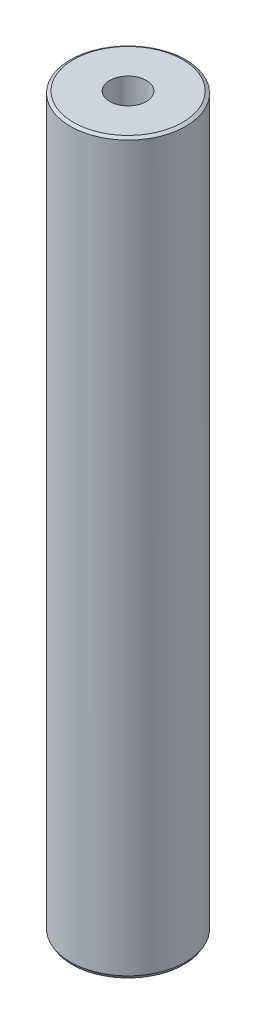
ISO-10303-21;
HEADER;
FILE_DESCRIPTION(('STEP AP214'),'2;1');
FILE_NAME('part.step','',(''),(''),'','','');
FILE_SCHEMA(('AUTOMOTIVE_DESIGN { 1 0 10303 214 1 1 1 1 }'));
ENDSEC;
DATA;
#1=APPLICATION_CONTEXT('core data for automotive mechanical design processes');
#2=APPLICATION_PROTOCOL_DEFINITION('international standard','automotive_design',2000,#1);
#3=PRODUCT_CONTEXT('',#1,'mechanical');
#4=PRODUCT('Part','Part','',(#3));
#5=PRODUCT_RELATED_PRODUCT_CATEGORY('part','',(#4));
#6=PRODUCT_DEFINITION_FORMATION('','',#4);
#7=PRODUCT_DEFINITION_CONTEXT('part definition',#1,'design');
#8=PRODUCT_DEFINITION('design','',#6,#7);
#9=PRODUCT_DEFINITION_SHAPE('','',#8);
#10=(LENGTH_UNIT() NAMED_UNIT(*) SI_UNIT(.MILLI.,.METRE.));
#11=(NAMED_UNIT(*) PLANE_ANGLE_UNIT() SI_UNIT($,.RADIAN.));
#12=(NAMED_UNIT(*) SI_UNIT($,.STERADIAN.) SOLID_ANGLE_UNIT());
#13=UNCERTAINTY_MEASURE_WITH_UNIT(LENGTH_MEASURE(1.E-05),#10,'distance_accuracy_value','');
#14=(GEOMETRIC_REPRESENTATION_CONTEXT(3) GLOBAL_UNCERTAINTY_ASSIGNED_CONTEXT((#13)) GLOBAL_UNIT_ASSIGNED_CONTEXT((#10,
#11,#12)) REPRESENTATION_CONTEXT('',''));
#15=CARTESIAN_POINT('',(0.,0.,0.));
#16=DIRECTION('',(0.,0.,1.));
#17=DIRECTION('',(1.,0.,0.));
#18=AXIS2_PLACEMENT_3D('',#15,#16,#17);
#19=CARTESIAN_POINT('',(0.,600.,0.));
#20=DIRECTION('',(0.,-1.,0.));
#21=DIRECTION('',(0.,0.,-1.));
#22=AXIS2_PLACEMENT_3D('',#19,#20,#21);
#23=CYLINDRICAL_SURFACE('',#22,47.5);
#24=CARTESIAN_POINT('',(0.,598.499511438825,0.));
#25=DIRECTION('',(0.,1.,0.));
#26=DIRECTION('',(0.,0.,1.));
#27=AXIS2_PLACEMENT_3D('',#24,#25,#26);
#28=CIRCLE('',#27,47.5);
#29=CARTESIAN_POINT('',(0.,598.499511438825,-47.5000000000001));
#30=VERTEX_POINT('',#29);
#31=EDGE_CURVE('E50',#30,#30,#28,.F.);
#32=ORIENTED_EDGE('',*,*,#31,.T.);
#33=EDGE_LOOP('',(#32));
#34=FACE_BOUND('',#33,.T.);
#35=CARTESIAN_POINT('',(0.,2.59892242413007,0.));
#36=DIRECTION('',(0.,1.,0.));
#37=DIRECTION('',(0.,0.,1.));
#38=AXIS2_PLACEMENT_3D('',#35,#36,#37);
#39=CIRCLE('',#38,47.5);
#40=CARTESIAN_POINT('',(0.,2.59892242413007,47.5));
#41=VERTEX_POINT('',#40);
#42=EDGE_CURVE('E51',#41,#41,#39,.T.);
#43=ORIENTED_EDGE('',*,*,#42,.T.);
#44=EDGE_LOOP('',(#43));
#45=FACE_BOUND('',#44,.T.);
#46=ADVANCED_FACE('F39',(#34,#45),#23,.T.);
#47=CARTESIAN_POINT('',(0.,600.,0.));
#48=DIRECTION('',(0.,1.,0.));
#49=DIRECTION('',(0.,0.,1.));
#50=AXIS2_PLACEMENT_3D('',#47,#48,#49);
#51=PLANE('',#50);
#52=CARTESIAN_POINT('',(0.,600.,0.));
#53=DIRECTION('',(0.,1.,0.));
#54=DIRECTION('',(0.,0.,1.));
#55=AXIS2_PLACEMENT_3D('',#52,#53,#54);
#56=CIRCLE('',#55,44.9010775758698);
#57=CARTESIAN_POINT('',(0.,600.,-44.9010775758699));
#58=VERTEX_POINT('',#57);
#59=EDGE_CURVE('E54',#58,#58,#56,.T.);
#60=ORIENTED_EDGE('',*,*,#59,.T.);
#61=EDGE_LOOP('',(#60));
#62=FACE_BOUND('',#61,.T.);
#63=CARTESIAN_POINT('',(0.,600.,0.));
#64=DIRECTION('',(0.,1.,0.));
#65=DIRECTION('',(0.,0.,1.));
#66=AXIS2_PLACEMENT_3D('',#63,#64,#65);
#67=CIRCLE('',#66,15.0719371050409);
#68=CARTESIAN_POINT('',(0.,600.,15.0719371050409));
#69=VERTEX_POINT('',#68);
#70=EDGE_CURVE('E58',#69,#69,#67,.T.);
#71=ORIENTED_EDGE('',*,*,#70,.F.);
#72=EDGE_LOOP('',(#71));
#73=FACE_BOUND('',#72,.T.);
#74=ADVANCED_FACE('F69',(#62,#73),#51,.T.);
#75=CARTESIAN_POINT('',(0.,0.,0.));
#76=DIRECTION('',(0.,1.,0.));
#77=DIRECTION('',(0.,0.,1.));
#78=AXIS2_PLACEMENT_3D('',#75,#76,#77);
#79=PLANE('',#78);
#80=CARTESIAN_POINT('',(0.,0.,0.));
#81=DIRECTION('',(0.,1.,0.));
#82=DIRECTION('',(0.,0.,1.));
#83=AXIS2_PLACEMENT_3D('',#80,#81,#82);
#84=CIRCLE('',#83,45.9995114388255);
#85=CARTESIAN_POINT('',(0.,0.,45.9995114388255));
#86=VERTEX_POINT('',#85);
#87=EDGE_CURVE('E10',#86,#86,#84,.F.);
#88=ORIENTED_EDGE('',*,*,#87,.T.);
#89=EDGE_LOOP('',(#88));
#90=FACE_BOUND('',#89,.T.);
#91=CARTESIAN_POINT('',(0.,0.,0.));
#92=DIRECTION('',(0.,1.,0.));
#93=DIRECTION('',(0.,0.,1.));
#94=AXIS2_PLACEMENT_3D('',#91,#92,#93);
#95=CIRCLE('',#94,15.0719371050409);
#96=CARTESIAN_POINT('',(0.,0.,15.0719371050409));
#97=VERTEX_POINT('',#96);
#98=EDGE_CURVE('E63',#97,#97,#95,.T.);
#99=ORIENTED_EDGE('',*,*,#98,.T.);
#100=EDGE_LOOP('',(#99));
#101=FACE_BOUND('',#100,.T.);
#102=ADVANCED_FACE('F75',(#90,#101),#79,.F.);
#103=CARTESIAN_POINT('',(0.,600.,0.));
#104=DIRECTION('',(0.,-1.,0.));
#105=DIRECTION('',(0.,0.,-1.));
#106=AXIS2_PLACEMENT_3D('',#103,#104,#105);
#107=CYLINDRICAL_SURFACE('',#106,15.0719371050409);
#108=ORIENTED_EDGE('',*,*,#70,.T.);
#109=EDGE_LOOP('',(#108));
#110=FACE_BOUND('',#109,.T.);
#111=ORIENTED_EDGE('',*,*,#98,.F.);
#112=EDGE_LOOP('',(#111));
#113=FACE_BOUND('',#112,.T.);
#114=ADVANCED_FACE('F70',(#110,#113),#107,.F.);
#115=CARTESIAN_POINT('',(0.,600.,0.));
#116=DIRECTION('',(0.,-1.,0.));
#117=DIRECTION('',(0.,0.,-1.));
#118=AXIS2_PLACEMENT_3D('',#115,#116,#117);
#119=CONICAL_SURFACE('',#118,44.9010775758698,1.04719755119662);
#120=CARTESIAN_POINT('',(0.,598.499511438825,-47.5000000000001));
#121=CARTESIAN_POINT('',(0.,598.515141528004,-47.4729278914154));
#122=CARTESIAN_POINT('',(0.,598.530771617183,-47.4458557828307));
#123=CARTESIAN_POINT('',(0.,598.562031795541,-47.3917115656613));
#124=CARTESIAN_POINT('',(0.,598.57766188472,-47.3646394570767));
#125=CARTESIAN_POINT('',(0.,598.608922063078,-47.3104952399073));
#126=CARTESIAN_POINT('',(0.,598.624552152257,-47.2834231313226));
#127=CARTESIAN_POINT('',(0.,598.655812330614,-47.2292789141532));
#128=CARTESIAN_POINT('',(0.,598.671442419793,-47.2022068055685));
#129=CARTESIAN_POINT('',(0.,598.702702598151,-47.1480625883991));
#130=CARTESIAN_POINT('',(0.,598.71833268733,-47.1209904798144));
#131=CARTESIAN_POINT('',(0.,598.749592865688,-47.0668462626451));
#132=CARTESIAN_POINT('',(0.,598.765222954867,-47.0397741540604));
#133=CARTESIAN_POINT('',(0.,598.796483133225,-46.985629936891));
#134=CARTESIAN_POINT('',(0.,598.812113222403,-46.9585578283063));
#135=CARTESIAN_POINT('',(0.,598.843373400761,-46.9044136111369));
#136=CARTESIAN_POINT('',(0.,598.85900348994,-46.8773415025522));
#137=CARTESIAN_POINT('',(0.,598.890263668298,-46.8231972853829));
#138=CARTESIAN_POINT('',(0.,598.905893757477,-46.7961251767982));
#139=CARTESIAN_POINT('',(0.,598.937153935835,-46.7419809596288));
#140=CARTESIAN_POINT('',(0.,598.952784025014,-46.7149088510441));
#141=CARTESIAN_POINT('',(0.,598.984044203371,-46.6607646338747));
#142=CARTESIAN_POINT('',(0.,598.99967429255,-46.63369252529));
#143=CARTESIAN_POINT('',(0.,599.030934470908,-46.5795483081207));
#144=CARTESIAN_POINT('',(0.,599.046564560087,-46.552476199536));
#145=CARTESIAN_POINT('',(0.,599.077824738445,-46.4983319823666));
#146=CARTESIAN_POINT('',(0.,599.093454827624,-46.4712598737819));
#147=CARTESIAN_POINT('',(0.,599.124715005982,-46.4171156566125));
#148=CARTESIAN_POINT('',(0.,599.14034509516,-46.3900435480278));
#149=CARTESIAN_POINT('',(0.,599.171605273518,-46.3358993308585));
#150=CARTESIAN_POINT('',(0.,599.187235362697,-46.3088272222737));
#151=CARTESIAN_POINT('',(0.,599.218495541055,-46.2546830051044));
#152=CARTESIAN_POINT('',(0.,599.234125630234,-46.2276108965197));
#153=CARTESIAN_POINT('',(0.,599.265385808592,-46.1734666793503));
#154=CARTESIAN_POINT('',(0.,599.281015897771,-46.1463945707656));
#155=CARTESIAN_POINT('',(0.,599.312276076128,-46.0922503535962));
#156=CARTESIAN_POINT('',(0.,599.327906165307,-46.0651782450116));
#157=CARTESIAN_POINT('',(0.,599.359166343665,-46.0110340278422));
#158=CARTESIAN_POINT('',(0.,599.374796432844,-45.9839619192575));
#159=CARTESIAN_POINT('',(0.,599.406056611202,-45.9298177020881));
#160=CARTESIAN_POINT('',(0.,599.421686700381,-45.9027455935034));
#161=CARTESIAN_POINT('',(0.,599.452946878738,-45.848601376334));
#162=CARTESIAN_POINT('',(0.,599.468576967917,-45.8215292677493));
#163=CARTESIAN_POINT('',(0.,599.499837146275,-45.76738505058));
#164=CARTESIAN_POINT('',(0.,599.515467235454,-45.7403129419953));
#165=CARTESIAN_POINT('',(0.,599.546727413812,-45.6861687248259));
#166=CARTESIAN_POINT('',(0.,599.562357502991,-45.6590966162412));
#167=CARTESIAN_POINT('',(0.,599.593617681349,-45.6049523990718));
#168=CARTESIAN_POINT('',(0.,599.609247770527,-45.5778802904871));
#169=CARTESIAN_POINT('',(0.,599.640507948885,-45.5237360733178));
#170=CARTESIAN_POINT('',(0.,599.656138038064,-45.4966639647331));
#171=CARTESIAN_POINT('',(0.,599.687398216422,-45.4425197475637));
#172=CARTESIAN_POINT('',(0.,599.703028305601,-45.415447638979));
#173=CARTESIAN_POINT('',(0.,599.734288483959,-45.3613034218096));
#174=CARTESIAN_POINT('',(0.,599.749918573138,-45.3342313132249));
#175=CARTESIAN_POINT('',(0.,599.781178751495,-45.2800870960556));
#176=CARTESIAN_POINT('',(0.,599.796808840674,-45.2530149874709));
#177=CARTESIAN_POINT('',(0.,599.828069019032,-45.1988707703015));
#178=CARTESIAN_POINT('',(0.,599.843699108211,-45.1717986617168));
#179=CARTESIAN_POINT('',(0.,599.874959286569,-45.1176544445474));
#180=CARTESIAN_POINT('',(0.,599.890589375748,-45.0905823359627));
#181=CARTESIAN_POINT('',(0.,599.921849554105,-45.0364381187933));
#182=CARTESIAN_POINT('',(0.,599.937479643284,-45.0093660102087));
#183=CARTESIAN_POINT('',(0.,599.968739821642,-44.9552217930393));
#184=CARTESIAN_POINT('',(0.,599.984369910821,-44.9281496844546));
#185=CARTESIAN_POINT('',(0.,600.,-44.9010775758699));
#186=B_SPLINE_CURVE_WITH_KNOTS('',3,(#120,#121,#122,#123,#124,#125,#126,#127,#128,#129,#130,
#131,#132,#133,#134,#135,#136,#137,#138,#139,#140,#141,#142,#143,#144,#145,#146,#147,#148,#149,
#150,#151,#152,#153,#154,#155,#156,#157,#158,#159,#160,#161,#162,#163,#164,#165,#166,#167,#168,
#169,#170,#171,#172,#173,#174,#175,#176,#177,#178,#179,#180,#181,#182,#183,#184,#185),
.UNSPECIFIED.,.F.,.F.,(4,2,2,2,2,2,2,2,2,2,2,2,2,2,2,2,2,2,2,2,2,2,2,2,2,2,2,2,2,2,2,2,4),(0.,
0.0937805350733989,0.187561070146792,0.281341605220191,0.37512214029359,0.468902675366982,
0.562683210440437,0.65646374551383,0.750244280587229,0.844024815660622,0.93780535073402,
1.03158588580747,1.12536642088087,1.21914695595427,1.31292749102766,1.40670802610106,
1.50048856117451,1.59426909624791,1.6880496313213,1.7818301663947,1.8756107014681,
1.9693912365415,2.06317177161494,2.15695230668834,2.25073284176174,2.34451337683513,
2.43829391190853,2.53207444698198,2.62585498205538,2.71963551712877,2.81341605220217,
2.90719658727557,3.00097712234902),.UNSPECIFIED.);
#187=EDGE_CURVE('BSEAM81',#30,#58,#186,.T.);
#188=ORIENTED_EDGE('',*,*,#31,.F.);
#189=ORIENTED_EDGE('',*,*,#59,.F.);
#190=ORIENTED_EDGE('',*,*,#187,.T.);
#191=ORIENTED_EDGE('',*,*,#187,.F.);
#192=EDGE_LOOP('',(#188,#190,#189,#191));
#193=FACE_BOUND('',#192,.T.);
#194=ADVANCED_FACE('F81',(#193),#119,.T.);
#195=CARTESIAN_POINT('',(0.,2.59892242413007,0.));
#196=DIRECTION('',(0.,1.,0.));
#197=DIRECTION('',(0.,0.,1.));
#198=AXIS2_PLACEMENT_3D('',#195,#196,#197);
#199=CONICAL_SURFACE('',#198,47.5,0.523598775598309);
#200=ORIENTED_EDGE('',*,*,#87,.F.);
#201=EDGE_LOOP('',(#200));
#202=FACE_BOUND('',#201,.T.);
#203=ORIENTED_EDGE('',*,*,#42,.F.);
#204=EDGE_LOOP('',(#203));
#205=FACE_BOUND('',#204,.T.);
#206=ADVANCED_FACE('F45',(#202,#205),#199,.T.);
#207=CLOSED_SHELL('',(#46,#74,#102,#114,#194,#206));
#208=MANIFOLD_SOLID_BREP('B2',#207);
#209=ADVANCED_BREP_SHAPE_REPRESENTATION('',(#18,#208),#14);
#210=SHAPE_DEFINITION_REPRESENTATION(#9,#209);
ENDSEC;
END-ISO-10303-21;
